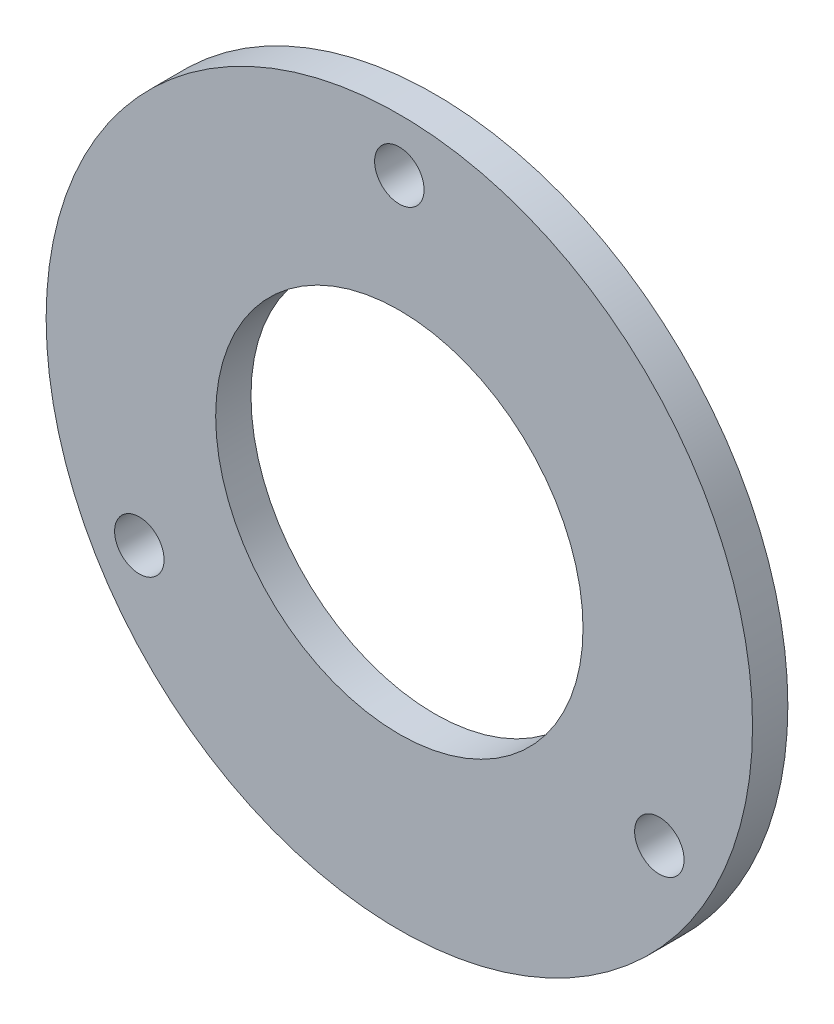
ISO-10303-21;
HEADER;
FILE_DESCRIPTION(('STEP AP214'),'2;1');
FILE_NAME('part.step','',(''),(''),'','','');
FILE_SCHEMA(('AUTOMOTIVE_DESIGN { 1 0 10303 214 1 1 1 1 }'));
ENDSEC;
DATA;
#1=APPLICATION_CONTEXT('core data for automotive mechanical design processes');
#2=APPLICATION_PROTOCOL_DEFINITION('international standard','automotive_design',2000,#1);
#3=PRODUCT_CONTEXT('',#1,'mechanical');
#4=PRODUCT('Part','Part','',(#3));
#5=PRODUCT_RELATED_PRODUCT_CATEGORY('part','',(#4));
#6=PRODUCT_DEFINITION_FORMATION('','',#4);
#7=PRODUCT_DEFINITION_CONTEXT('part definition',#1,'design');
#8=PRODUCT_DEFINITION('design','',#6,#7);
#9=PRODUCT_DEFINITION_SHAPE('','',#8);
#10=(LENGTH_UNIT() NAMED_UNIT(*) SI_UNIT(.MILLI.,.METRE.));
#11=(NAMED_UNIT(*) PLANE_ANGLE_UNIT() SI_UNIT($,.RADIAN.));
#12=(NAMED_UNIT(*) SI_UNIT($,.STERADIAN.) SOLID_ANGLE_UNIT());
#13=UNCERTAINTY_MEASURE_WITH_UNIT(LENGTH_MEASURE(1.E-05),#10,'distance_accuracy_value','');
#14=(GEOMETRIC_REPRESENTATION_CONTEXT(3) GLOBAL_UNCERTAINTY_ASSIGNED_CONTEXT((#13)) GLOBAL_UNIT_ASSIGNED_CONTEXT((#10,
#11,#12)) REPRESENTATION_CONTEXT('',''));
#15=CARTESIAN_POINT('',(0.,0.,0.));
#16=DIRECTION('',(0.,0.,1.));
#17=DIRECTION('',(1.,0.,0.));
#18=AXIS2_PLACEMENT_3D('',#15,#16,#17);
#19=CARTESIAN_POINT('',(0.,0.,5.));
#20=DIRECTION('',(0.,0.,1.));
#21=DIRECTION('',(1.,0.,0.));
#22=AXIS2_PLACEMENT_3D('',#19,#20,#21);
#23=PLANE('',#22);
#24=CARTESIAN_POINT('',(0.,42.5,5.));
#25=DIRECTION('',(0.,0.,1.));
#26=DIRECTION('',(1.,0.,0.));
#27=AXIS2_PLACEMENT_3D('',#24,#25,#26);
#28=CIRCLE('',#27,3.5);
#29=CARTESIAN_POINT('',(3.5,42.5,5.));
#30=VERTEX_POINT('',#29);
#31=EDGE_CURVE('E60',#30,#30,#28,.T.);
#32=ORIENTED_EDGE('',*,*,#31,.F.);
#33=EDGE_LOOP('',(#32));
#34=FACE_BOUND('',#33,.T.);
#35=CARTESIAN_POINT('',(36.8060796608405,-21.249999999999,5.));
#36=DIRECTION('',(0.,0.,1.));
#37=DIRECTION('',(1.,0.,0.));
#38=AXIS2_PLACEMENT_3D('',#35,#36,#37);
#39=CIRCLE('',#38,3.50000000000162);
#40=CARTESIAN_POINT('',(40.3060796608421,-21.249999999999,5.));
#41=VERTEX_POINT('',#40);
#42=EDGE_CURVE('E67',#41,#41,#39,.T.);
#43=ORIENTED_EDGE('',*,*,#42,.F.);
#44=EDGE_LOOP('',(#43));
#45=FACE_BOUND('',#44,.T.);
#46=CARTESIAN_POINT('',(-36.8060796608369,-21.250000000001,5.));
#47=DIRECTION('',(0.,0.,1.));
#48=DIRECTION('',(1.,0.,0.));
#49=AXIS2_PLACEMENT_3D('',#46,#47,#48);
#50=CIRCLE('',#49,3.50000000000238);
#51=CARTESIAN_POINT('',(-33.3060796608345,-21.250000000001,5.));
#52=VERTEX_POINT('',#51);
#53=EDGE_CURVE('E71',#52,#52,#50,.T.);
#54=ORIENTED_EDGE('',*,*,#53,.F.);
#55=EDGE_LOOP('',(#54));
#56=FACE_BOUND('',#55,.T.);
#57=CARTESIAN_POINT('',(0.,0.,5.));
#58=DIRECTION('',(0.,0.,1.));
#59=DIRECTION('',(1.,0.,0.));
#60=AXIS2_PLACEMENT_3D('',#57,#58,#59);
#61=CIRCLE('',#60,50.);
#62=CARTESIAN_POINT('',(50.,0.,5.));
#63=VERTEX_POINT('',#62);
#64=EDGE_CURVE('E10',#63,#63,#61,.T.);
#65=ORIENTED_EDGE('',*,*,#64,.T.);
#66=EDGE_LOOP('',(#65));
#67=FACE_BOUND('',#66,.T.);
#68=CARTESIAN_POINT('',(0.,0.,5.));
#69=DIRECTION('',(0.,0.,1.));
#70=DIRECTION('',(1.,0.,0.));
#71=AXIS2_PLACEMENT_3D('',#68,#69,#70);
#72=CIRCLE('',#71,26.);
#73=CARTESIAN_POINT('',(26.,0.,5.));
#74=VERTEX_POINT('',#73);
#75=EDGE_CURVE('E54',#74,#74,#72,.T.);
#76=ORIENTED_EDGE('',*,*,#75,.F.);
#77=EDGE_LOOP('',(#76));
#78=FACE_BOUND('',#77,.T.);
#79=ADVANCED_FACE('F41',(#34,#45,#56,#67,#78),#23,.T.);
#80=CARTESIAN_POINT('',(0.,0.,0.));
#81=DIRECTION('',(0.,0.,1.));
#82=DIRECTION('',(1.,0.,0.));
#83=AXIS2_PLACEMENT_3D('',#80,#81,#82);
#84=PLANE('',#83);
#85=CARTESIAN_POINT('',(0.,42.5,0.));
#86=DIRECTION('',(0.,0.,1.));
#87=DIRECTION('',(1.,0.,0.));
#88=AXIS2_PLACEMENT_3D('',#85,#86,#87);
#89=CIRCLE('',#88,3.5);
#90=CARTESIAN_POINT('',(3.5,42.5,0.));
#91=VERTEX_POINT('',#90);
#92=EDGE_CURVE('E75',#91,#91,#89,.T.);
#93=ORIENTED_EDGE('',*,*,#92,.T.);
#94=EDGE_LOOP('',(#93));
#95=FACE_BOUND('',#94,.T.);
#96=CARTESIAN_POINT('',(36.8060796608405,-21.249999999999,0.));
#97=DIRECTION('',(0.,0.,1.));
#98=DIRECTION('',(1.,0.,0.));
#99=AXIS2_PLACEMENT_3D('',#96,#97,#98);
#100=CIRCLE('',#99,3.50000000000162);
#101=CARTESIAN_POINT('',(40.3060796608421,-21.249999999999,0.));
#102=VERTEX_POINT('',#101);
#103=EDGE_CURVE('E80',#102,#102,#100,.T.);
#104=ORIENTED_EDGE('',*,*,#103,.T.);
#105=EDGE_LOOP('',(#104));
#106=FACE_BOUND('',#105,.T.);
#107=CARTESIAN_POINT('',(-36.8060796608369,-21.250000000001,0.));
#108=DIRECTION('',(0.,0.,1.));
#109=DIRECTION('',(1.,0.,0.));
#110=AXIS2_PLACEMENT_3D('',#107,#108,#109);
#111=CIRCLE('',#110,3.50000000000238);
#112=CARTESIAN_POINT('',(-33.3060796608345,-21.250000000001,0.));
#113=VERTEX_POINT('',#112);
#114=EDGE_CURVE('E76',#113,#113,#111,.T.);
#115=ORIENTED_EDGE('',*,*,#114,.T.);
#116=EDGE_LOOP('',(#115));
#117=FACE_BOUND('',#116,.T.);
#118=CARTESIAN_POINT('',(0.,0.,0.));
#119=DIRECTION('',(0.,0.,1.));
#120=DIRECTION('',(1.,0.,0.));
#121=AXIS2_PLACEMENT_3D('',#118,#119,#120);
#122=CIRCLE('',#121,50.);
#123=CARTESIAN_POINT('',(50.,0.,0.));
#124=VERTEX_POINT('',#123);
#125=EDGE_CURVE('E45',#124,#124,#122,.T.);
#126=ORIENTED_EDGE('',*,*,#125,.F.);
#127=EDGE_LOOP('',(#126));
#128=FACE_BOUND('',#127,.T.);
#129=CARTESIAN_POINT('',(0.,0.,0.));
#130=DIRECTION('',(0.,0.,1.));
#131=DIRECTION('',(1.,0.,0.));
#132=AXIS2_PLACEMENT_3D('',#129,#130,#131);
#133=CIRCLE('',#132,26.);
#134=CARTESIAN_POINT('',(26.,0.,0.));
#135=VERTEX_POINT('',#134);
#136=EDGE_CURVE('E56',#135,#135,#133,.T.);
#137=ORIENTED_EDGE('',*,*,#136,.T.);
#138=EDGE_LOOP('',(#137));
#139=FACE_BOUND('',#138,.T.);
#140=ADVANCED_FACE('F88',(#95,#106,#117,#128,#139),#84,.F.);
#141=CARTESIAN_POINT('',(0.,0.,5.));
#142=DIRECTION('',(0.,0.,-1.));
#143=DIRECTION('',(-1.,0.,0.));
#144=AXIS2_PLACEMENT_3D('',#141,#142,#143);
#145=CYLINDRICAL_SURFACE('',#144,50.);
#146=ORIENTED_EDGE('',*,*,#64,.F.);
#147=EDGE_LOOP('',(#146));
#148=FACE_BOUND('',#147,.T.);
#149=ORIENTED_EDGE('',*,*,#125,.T.);
#150=EDGE_LOOP('',(#149));
#151=FACE_BOUND('',#150,.T.);
#152=ADVANCED_FACE('F43',(#148,#151),#145,.T.);
#153=CARTESIAN_POINT('',(0.,0.,5.));
#154=DIRECTION('',(0.,0.,-1.));
#155=DIRECTION('',(-1.,0.,0.));
#156=AXIS2_PLACEMENT_3D('',#153,#154,#155);
#157=CYLINDRICAL_SURFACE('',#156,26.);
#158=ORIENTED_EDGE('',*,*,#75,.T.);
#159=EDGE_LOOP('',(#158));
#160=FACE_BOUND('',#159,.T.);
#161=ORIENTED_EDGE('',*,*,#136,.F.);
#162=EDGE_LOOP('',(#161));
#163=FACE_BOUND('',#162,.T.);
#164=ADVANCED_FACE('F111',(#160,#163),#157,.F.);
#165=CARTESIAN_POINT('',(-36.8060796608369,-21.250000000001,0.));
#166=DIRECTION('',(0.,0.,1.));
#167=DIRECTION('',(1.,0.,0.));
#168=AXIS2_PLACEMENT_3D('',#165,#166,#167);
#169=CYLINDRICAL_SURFACE('',#168,3.50000000000238);
#170=ORIENTED_EDGE('',*,*,#53,.T.);
#171=EDGE_LOOP('',(#170));
#172=FACE_BOUND('',#171,.T.);
#173=ORIENTED_EDGE('',*,*,#114,.F.);
#174=EDGE_LOOP('',(#173));
#175=FACE_BOUND('',#174,.T.);
#176=ADVANCED_FACE('F99',(#172,#175),#169,.F.);
#177=CARTESIAN_POINT('',(36.8060796608405,-21.249999999999,0.));
#178=DIRECTION('',(0.,0.,1.));
#179=DIRECTION('',(1.,0.,0.));
#180=AXIS2_PLACEMENT_3D('',#177,#178,#179);
#181=CYLINDRICAL_SURFACE('',#180,3.50000000000162);
#182=ORIENTED_EDGE('',*,*,#42,.T.);
#183=EDGE_LOOP('',(#182));
#184=FACE_BOUND('',#183,.T.);
#185=ORIENTED_EDGE('',*,*,#103,.F.);
#186=EDGE_LOOP('',(#185));
#187=FACE_BOUND('',#186,.T.);
#188=ADVANCED_FACE('F93',(#184,#187),#181,.F.);
#189=CARTESIAN_POINT('',(0.,42.5,0.));
#190=DIRECTION('',(0.,0.,1.));
#191=DIRECTION('',(1.,0.,0.));
#192=AXIS2_PLACEMENT_3D('',#189,#190,#191);
#193=CYLINDRICAL_SURFACE('',#192,3.5);
#194=ORIENTED_EDGE('',*,*,#31,.T.);
#195=EDGE_LOOP('',(#194));
#196=FACE_BOUND('',#195,.T.);
#197=ORIENTED_EDGE('',*,*,#92,.F.);
#198=EDGE_LOOP('',(#197));
#199=FACE_BOUND('',#198,.T.);
#200=ADVANCED_FACE('F91',(#196,#199),#193,.F.);
#201=CLOSED_SHELL('',(#79,#140,#152,#164,#176,#188,#200));
#202=MANIFOLD_SOLID_BREP('B2',#201);
#203=ADVANCED_BREP_SHAPE_REPRESENTATION('',(#18,#202),#14);
#204=SHAPE_DEFINITION_REPRESENTATION(#9,#203);
ENDSEC;
END-ISO-10303-21;
